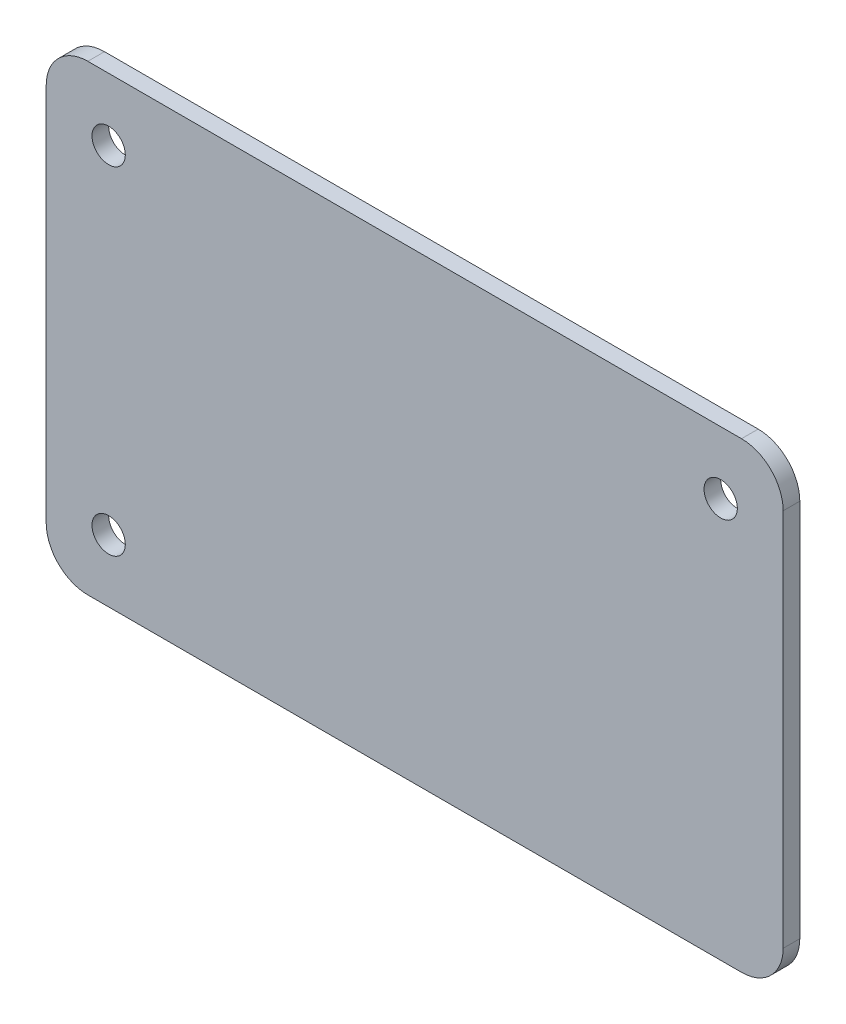
ISO-10303-21;
HEADER;
FILE_DESCRIPTION(('STEP AP214'),'2;1');
FILE_NAME('part.step','',(''),(''),'','','');
FILE_SCHEMA(('AUTOMOTIVE_DESIGN { 1 0 10303 214 1 1 1 1 }'));
ENDSEC;
DATA;
#1=APPLICATION_CONTEXT('core data for automotive mechanical design processes');
#2=APPLICATION_PROTOCOL_DEFINITION('international standard','automotive_design',2000,#1);
#3=PRODUCT_CONTEXT('',#1,'mechanical');
#4=PRODUCT('Part','Part','',(#3));
#5=PRODUCT_RELATED_PRODUCT_CATEGORY('part','',(#4));
#6=PRODUCT_DEFINITION_FORMATION('','',#4);
#7=PRODUCT_DEFINITION_CONTEXT('part definition',#1,'design');
#8=PRODUCT_DEFINITION('design','',#6,#7);
#9=PRODUCT_DEFINITION_SHAPE('','',#8);
#10=(LENGTH_UNIT() NAMED_UNIT(*) SI_UNIT(.MILLI.,.METRE.));
#11=(NAMED_UNIT(*) PLANE_ANGLE_UNIT() SI_UNIT($,.RADIAN.));
#12=(NAMED_UNIT(*) SI_UNIT($,.STERADIAN.) SOLID_ANGLE_UNIT());
#13=UNCERTAINTY_MEASURE_WITH_UNIT(LENGTH_MEASURE(1.E-05),#10,'distance_accuracy_value','');
#14=(GEOMETRIC_REPRESENTATION_CONTEXT(3) GLOBAL_UNCERTAINTY_ASSIGNED_CONTEXT((#13)) GLOBAL_UNIT_ASSIGNED_CONTEXT((#10,
#11,#12)) REPRESENTATION_CONTEXT('',''));
#15=CARTESIAN_POINT('',(0.,0.,0.));
#16=DIRECTION('',(0.,0.,1.));
#17=DIRECTION('',(1.,0.,0.));
#18=AXIS2_PLACEMENT_3D('',#15,#16,#17);
#19=CARTESIAN_POINT('',(-78.5,-45.5,4.));
#20=DIRECTION('',(0.,0.,-1.));
#21=DIRECTION('',(-1.,0.,0.));
#22=AXIS2_PLACEMENT_3D('',#19,#20,#21);
#23=PLANE('',#22);
#24=CARTESIAN_POINT('',(-78.5,-45.5,4.));
#25=DIRECTION('',(0.,0.,1.));
#26=DIRECTION('',(-1.,0.,0.));
#27=AXIS2_PLACEMENT_3D('',#24,#25,#26);
#28=CIRCLE('',#27,10.);
#29=CARTESIAN_POINT('',(-88.5,-45.4999999999999,4.));
#30=VERTEX_POINT('',#29);
#31=CARTESIAN_POINT('',(-78.4999999999999,-55.5,4.));
#32=VERTEX_POINT('',#31);
#33=EDGE_CURVE('E145',#30,#32,#28,.T.);
#34=ORIENTED_EDGE('',*,*,#33,.T.);
#35=DIRECTION('',(1.,0.,0.));
#36=VECTOR('',#35,1.);
#37=CARTESIAN_POINT('',(78.4999999999999,-55.5,4.));
#38=LINE('',#37,#36);
#39=CARTESIAN_POINT('',(78.4999999999999,-55.5,4.));
#40=VERTEX_POINT('',#39);
#41=EDGE_CURVE('E93',#32,#40,#38,.T.);
#42=ORIENTED_EDGE('',*,*,#41,.T.);
#43=CARTESIAN_POINT('',(78.5,-45.5,4.));
#44=DIRECTION('',(0.,0.,1.));
#45=DIRECTION('',(1.,0.,0.));
#46=AXIS2_PLACEMENT_3D('',#43,#44,#45);
#47=CIRCLE('',#46,10.);
#48=CARTESIAN_POINT('',(88.5,-45.5,4.));
#49=VERTEX_POINT('',#48);
#50=EDGE_CURVE('E160',#40,#49,#47,.T.);
#51=ORIENTED_EDGE('',*,*,#50,.T.);
#52=DIRECTION('',(0.,1.,0.));
#53=VECTOR('',#52,1.);
#54=CARTESIAN_POINT('',(88.5,-45.4999999999999,4.));
#55=LINE('',#54,#53);
#56=CARTESIAN_POINT('',(88.5,45.4999999999999,4.));
#57=VERTEX_POINT('',#56);
#58=EDGE_CURVE('E173',#49,#57,#55,.T.);
#59=ORIENTED_EDGE('',*,*,#58,.T.);
#60=CARTESIAN_POINT('',(78.5,45.5,4.));
#61=DIRECTION('',(0.,0.,1.));
#62=DIRECTION('',(1.,0.,0.));
#63=AXIS2_PLACEMENT_3D('',#60,#61,#62);
#64=CIRCLE('',#63,10.);
#65=CARTESIAN_POINT('',(78.4999999999999,55.5,4.));
#66=VERTEX_POINT('',#65);
#67=EDGE_CURVE('E112',#57,#66,#64,.T.);
#68=ORIENTED_EDGE('',*,*,#67,.T.);
#69=DIRECTION('',(-1.,0.,0.));
#70=VECTOR('',#69,1.);
#71=CARTESIAN_POINT('',(78.4999999999999,55.5,4.));
#72=LINE('',#71,#70);
#73=CARTESIAN_POINT('',(-78.4999999999999,55.5,4.));
#74=VERTEX_POINT('',#73);
#75=EDGE_CURVE('E106',#66,#74,#72,.T.);
#76=ORIENTED_EDGE('',*,*,#75,.T.);
#77=CARTESIAN_POINT('',(-78.5,45.5,4.));
#78=DIRECTION('',(0.,0.,1.));
#79=DIRECTION('',(1.,0.,0.));
#80=AXIS2_PLACEMENT_3D('',#77,#78,#79);
#81=CIRCLE('',#80,10.);
#82=CARTESIAN_POINT('',(-88.5,45.4999999999999,4.));
#83=VERTEX_POINT('',#82);
#84=EDGE_CURVE('E110',#74,#83,#81,.T.);
#85=ORIENTED_EDGE('',*,*,#84,.T.);
#86=DIRECTION('',(0.,-1.,0.));
#87=VECTOR('',#86,1.);
#88=CARTESIAN_POINT('',(-88.5,-45.4999999999999,4.));
#89=LINE('',#88,#87);
#90=EDGE_CURVE('E50',#83,#30,#89,.T.);
#91=ORIENTED_EDGE('',*,*,#90,.T.);
#92=EDGE_LOOP('',(#34,#42,#51,#59,#68,#76,#85,#91));
#93=FACE_BOUND('',#92,.T.);
#94=CARTESIAN_POINT('',(-73.5,40.5,4.));
#95=DIRECTION('',(0.,0.,1.));
#96=DIRECTION('',(1.,0.,0.));
#97=AXIS2_PLACEMENT_3D('',#94,#95,#96);
#98=CIRCLE('',#97,4.00000000000001);
#99=CARTESIAN_POINT('',(-69.5,40.5,4.));
#100=VERTEX_POINT('',#99);
#101=EDGE_CURVE('E134',#100,#100,#98,.T.);
#102=ORIENTED_EDGE('',*,*,#101,.F.);
#103=EDGE_LOOP('',(#102));
#104=FACE_BOUND('',#103,.T.);
#105=CARTESIAN_POINT('',(73.5,40.5,4.));
#106=DIRECTION('',(0.,0.,1.));
#107=DIRECTION('',(1.,0.,0.));
#108=AXIS2_PLACEMENT_3D('',#105,#106,#107);
#109=CIRCLE('',#108,4.00000000000001);
#110=CARTESIAN_POINT('',(77.5,40.5,4.));
#111=VERTEX_POINT('',#110);
#112=EDGE_CURVE('E182',#111,#111,#109,.T.);
#113=ORIENTED_EDGE('',*,*,#112,.F.);
#114=EDGE_LOOP('',(#113));
#115=FACE_BOUND('',#114,.T.);
#116=CARTESIAN_POINT('',(-73.5,-40.5,4.));
#117=DIRECTION('',(0.,0.,1.));
#118=DIRECTION('',(1.,0.,0.));
#119=AXIS2_PLACEMENT_3D('',#116,#117,#118);
#120=CIRCLE('',#119,4.00000000000001);
#121=CARTESIAN_POINT('',(-69.5,-40.5,4.));
#122=VERTEX_POINT('',#121);
#123=EDGE_CURVE('E188',#122,#122,#120,.T.);
#124=ORIENTED_EDGE('',*,*,#123,.F.);
#125=EDGE_LOOP('',(#124));
#126=FACE_BOUND('',#125,.T.);
#127=ADVANCED_FACE('F33',(#93,#104,#115,#126),#23,.F.);
#128=CARTESIAN_POINT('',(-78.5,-45.5,0.));
#129=DIRECTION('',(0.,0.,-1.));
#130=DIRECTION('',(-1.,0.,0.));
#131=AXIS2_PLACEMENT_3D('',#128,#129,#130);
#132=PLANE('',#131);
#133=CARTESIAN_POINT('',(73.5,40.5,0.));
#134=DIRECTION('',(0.,0.,1.));
#135=DIRECTION('',(1.,0.,0.));
#136=AXIS2_PLACEMENT_3D('',#133,#134,#135);
#137=CIRCLE('',#136,4.00000000000001);
#138=CARTESIAN_POINT('',(77.5,40.5,0.));
#139=VERTEX_POINT('',#138);
#140=EDGE_CURVE('E185',#139,#139,#137,.T.);
#141=ORIENTED_EDGE('',*,*,#140,.T.);
#142=EDGE_LOOP('',(#141));
#143=FACE_BOUND('',#142,.T.);
#144=CARTESIAN_POINT('',(-78.5,-45.5,0.));
#145=DIRECTION('',(0.,0.,1.));
#146=DIRECTION('',(-1.,0.,0.));
#147=AXIS2_PLACEMENT_3D('',#144,#145,#146);
#148=CIRCLE('',#147,10.);
#149=CARTESIAN_POINT('',(-88.5,-45.4999999999999,0.));
#150=VERTEX_POINT('',#149);
#151=CARTESIAN_POINT('',(-78.4999999999999,-55.5,0.));
#152=VERTEX_POINT('',#151);
#153=EDGE_CURVE('E130',#150,#152,#148,.T.);
#154=ORIENTED_EDGE('',*,*,#153,.F.);
#155=DIRECTION('',(0.,-1.,0.));
#156=VECTOR('',#155,1.);
#157=CARTESIAN_POINT('',(-88.5,-45.4999999999999,0.));
#158=LINE('',#157,#156);
#159=CARTESIAN_POINT('',(-88.5,45.4999999999999,0.));
#160=VERTEX_POINT('',#159);
#161=EDGE_CURVE('E85',#160,#150,#158,.T.);
#162=ORIENTED_EDGE('',*,*,#161,.F.);
#163=CARTESIAN_POINT('',(-78.5,45.5,0.));
#164=DIRECTION('',(0.,0.,1.));
#165=DIRECTION('',(1.,0.,0.));
#166=AXIS2_PLACEMENT_3D('',#163,#164,#165);
#167=CIRCLE('',#166,10.);
#168=CARTESIAN_POINT('',(-78.4999999999999,55.5,0.));
#169=VERTEX_POINT('',#168);
#170=EDGE_CURVE('E79',#169,#160,#167,.T.);
#171=ORIENTED_EDGE('',*,*,#170,.F.);
#172=DIRECTION('',(-1.,0.,0.));
#173=VECTOR('',#172,1.);
#174=CARTESIAN_POINT('',(78.4999999999999,55.5,0.));
#175=LINE('',#174,#173);
#176=CARTESIAN_POINT('',(78.4999999999999,55.5,0.));
#177=VERTEX_POINT('',#176);
#178=EDGE_CURVE('E120',#177,#169,#175,.T.);
#179=ORIENTED_EDGE('',*,*,#178,.F.);
#180=CARTESIAN_POINT('',(78.5,45.5,0.));
#181=DIRECTION('',(0.,0.,1.));
#182=DIRECTION('',(1.,0.,0.));
#183=AXIS2_PLACEMENT_3D('',#180,#181,#182);
#184=CIRCLE('',#183,10.);
#185=CARTESIAN_POINT('',(88.5,45.4999999999999,0.));
#186=VERTEX_POINT('',#185);
#187=EDGE_CURVE('E140',#186,#177,#184,.T.);
#188=ORIENTED_EDGE('',*,*,#187,.F.);
#189=DIRECTION('',(0.,1.,0.));
#190=VECTOR('',#189,1.);
#191=CARTESIAN_POINT('',(88.5,-45.4999999999999,0.));
#192=LINE('',#191,#190);
#193=CARTESIAN_POINT('',(88.5,-45.5,0.));
#194=VERTEX_POINT('',#193);
#195=EDGE_CURVE('E138',#194,#186,#192,.T.);
#196=ORIENTED_EDGE('',*,*,#195,.F.);
#197=CARTESIAN_POINT('',(78.5,-45.5,0.));
#198=DIRECTION('',(0.,0.,1.));
#199=DIRECTION('',(1.,0.,0.));
#200=AXIS2_PLACEMENT_3D('',#197,#198,#199);
#201=CIRCLE('',#200,10.);
#202=CARTESIAN_POINT('',(78.4999999999999,-55.5,0.));
#203=VERTEX_POINT('',#202);
#204=EDGE_CURVE('E136',#203,#194,#201,.T.);
#205=ORIENTED_EDGE('',*,*,#204,.F.);
#206=DIRECTION('',(1.,0.,0.));
#207=VECTOR('',#206,1.);
#208=CARTESIAN_POINT('',(78.4999999999999,-55.5,0.));
#209=LINE('',#208,#207);
#210=EDGE_CURVE('E133',#152,#203,#209,.T.);
#211=ORIENTED_EDGE('',*,*,#210,.F.);
#212=EDGE_LOOP('',(#154,#162,#171,#179,#188,#196,#205,#211));
#213=FACE_BOUND('',#212,.T.);
#214=CARTESIAN_POINT('',(-73.5,40.5,0.));
#215=DIRECTION('',(0.,0.,1.));
#216=DIRECTION('',(1.,0.,0.));
#217=AXIS2_PLACEMENT_3D('',#214,#215,#216);
#218=CIRCLE('',#217,4.00000000000001);
#219=CARTESIAN_POINT('',(-69.5,40.5,0.));
#220=VERTEX_POINT('',#219);
#221=EDGE_CURVE('E179',#220,#220,#218,.T.);
#222=ORIENTED_EDGE('',*,*,#221,.T.);
#223=EDGE_LOOP('',(#222));
#224=FACE_BOUND('',#223,.T.);
#225=CARTESIAN_POINT('',(-73.5,-40.5,0.));
#226=DIRECTION('',(0.,0.,1.));
#227=DIRECTION('',(1.,0.,0.));
#228=AXIS2_PLACEMENT_3D('',#225,#226,#227);
#229=CIRCLE('',#228,4.00000000000001);
#230=CARTESIAN_POINT('',(-69.5,-40.5,0.));
#231=VERTEX_POINT('',#230);
#232=EDGE_CURVE('E191',#231,#231,#229,.T.);
#233=ORIENTED_EDGE('',*,*,#232,.T.);
#234=EDGE_LOOP('',(#233));
#235=FACE_BOUND('',#234,.T.);
#236=ADVANCED_FACE('F164',(#143,#213,#224,#235),#132,.T.);
#237=CARTESIAN_POINT('',(-78.5,-45.5,4.));
#238=DIRECTION('',(0.,0.,-1.));
#239=DIRECTION('',(-1.,0.,0.));
#240=AXIS2_PLACEMENT_3D('',#237,#238,#239);
#241=CYLINDRICAL_SURFACE('',#240,10.);
#242=ORIENTED_EDGE('',*,*,#153,.T.);
#243=DIRECTION('',(0.,0.,-1.));
#244=VECTOR('',#243,1.);
#245=CARTESIAN_POINT('',(-78.4999999999999,-55.5,4.));
#246=LINE('',#245,#244);
#247=EDGE_CURVE('E11',#32,#152,#246,.T.);
#248=ORIENTED_EDGE('',*,*,#247,.F.);
#249=ORIENTED_EDGE('',*,*,#33,.F.);
#250=DIRECTION('',(0.,0.,-1.));
#251=VECTOR('',#250,1.);
#252=CARTESIAN_POINT('',(-88.5,-45.4999999999999,4.));
#253=LINE('',#252,#251);
#254=EDGE_CURVE('E126',#30,#150,#253,.T.);
#255=ORIENTED_EDGE('',*,*,#254,.T.);
#256=EDGE_LOOP('',(#242,#248,#249,#255));
#257=FACE_BOUND('',#256,.T.);
#258=ADVANCED_FACE('F35',(#257),#241,.T.);
#259=CARTESIAN_POINT('',(78.4999999999999,-55.5,4.));
#260=DIRECTION('',(0.,1.,0.));
#261=DIRECTION('',(-1.,0.,0.));
#262=AXIS2_PLACEMENT_3D('',#259,#260,#261);
#263=PLANE('',#262);
#264=ORIENTED_EDGE('',*,*,#210,.T.);
#265=DIRECTION('',(0.,0.,-1.));
#266=VECTOR('',#265,1.);
#267=CARTESIAN_POINT('',(78.4999999999999,-55.5,4.));
#268=LINE('',#267,#266);
#269=EDGE_CURVE('E42',#40,#203,#268,.T.);
#270=ORIENTED_EDGE('',*,*,#269,.F.);
#271=ORIENTED_EDGE('',*,*,#41,.F.);
#272=ORIENTED_EDGE('',*,*,#247,.T.);
#273=EDGE_LOOP('',(#264,#270,#271,#272));
#274=FACE_BOUND('',#273,.T.);
#275=ADVANCED_FACE('F223',(#274),#263,.F.);
#276=CARTESIAN_POINT('',(78.5,-45.5,4.));
#277=DIRECTION('',(0.,0.,-1.));
#278=DIRECTION('',(-1.,0.,0.));
#279=AXIS2_PLACEMENT_3D('',#276,#277,#278);
#280=CYLINDRICAL_SURFACE('',#279,10.);
#281=ORIENTED_EDGE('',*,*,#204,.T.);
#282=DIRECTION('',(0.,0.,-1.));
#283=VECTOR('',#282,1.);
#284=CARTESIAN_POINT('',(88.5,-45.5,4.));
#285=LINE('',#284,#283);
#286=EDGE_CURVE('E152',#49,#194,#285,.T.);
#287=ORIENTED_EDGE('',*,*,#286,.F.);
#288=ORIENTED_EDGE('',*,*,#50,.F.);
#289=ORIENTED_EDGE('',*,*,#269,.T.);
#290=EDGE_LOOP('',(#281,#287,#288,#289));
#291=FACE_BOUND('',#290,.T.);
#292=ADVANCED_FACE('F158',(#291),#280,.T.);
#293=CARTESIAN_POINT('',(88.5,-45.4999999999999,4.));
#294=DIRECTION('',(-1.,0.,0.));
#295=DIRECTION('',(0.,-1.,0.));
#296=AXIS2_PLACEMENT_3D('',#293,#294,#295);
#297=PLANE('',#296);
#298=ORIENTED_EDGE('',*,*,#195,.T.);
#299=DIRECTION('',(0.,0.,-1.));
#300=VECTOR('',#299,1.);
#301=CARTESIAN_POINT('',(88.5,45.4999999999999,4.));
#302=LINE('',#301,#300);
#303=EDGE_CURVE('E149',#57,#186,#302,.T.);
#304=ORIENTED_EDGE('',*,*,#303,.F.);
#305=ORIENTED_EDGE('',*,*,#58,.F.);
#306=ORIENTED_EDGE('',*,*,#286,.T.);
#307=EDGE_LOOP('',(#298,#304,#305,#306));
#308=FACE_BOUND('',#307,.T.);
#309=ADVANCED_FACE('F169',(#308),#297,.F.);
#310=CARTESIAN_POINT('',(78.5,45.5,4.));
#311=DIRECTION('',(0.,0.,-1.));
#312=DIRECTION('',(-1.,0.,0.));
#313=AXIS2_PLACEMENT_3D('',#310,#311,#312);
#314=CYLINDRICAL_SURFACE('',#313,10.);
#315=ORIENTED_EDGE('',*,*,#187,.T.);
#316=DIRECTION('',(0.,0.,-1.));
#317=VECTOR('',#316,1.);
#318=CARTESIAN_POINT('',(78.4999999999999,55.5,4.));
#319=LINE('',#318,#317);
#320=EDGE_CURVE('E121',#66,#177,#319,.T.);
#321=ORIENTED_EDGE('',*,*,#320,.F.);
#322=ORIENTED_EDGE('',*,*,#67,.F.);
#323=ORIENTED_EDGE('',*,*,#303,.T.);
#324=EDGE_LOOP('',(#315,#321,#322,#323));
#325=FACE_BOUND('',#324,.T.);
#326=ADVANCED_FACE('F172',(#325),#314,.T.);
#327=CARTESIAN_POINT('',(78.4999999999999,55.5,4.));
#328=DIRECTION('',(0.,-1.,0.));
#329=DIRECTION('',(1.,0.,0.));
#330=AXIS2_PLACEMENT_3D('',#327,#328,#329);
#331=PLANE('',#330);
#332=ORIENTED_EDGE('',*,*,#178,.T.);
#333=DIRECTION('',(0.,0.,-1.));
#334=VECTOR('',#333,1.);
#335=CARTESIAN_POINT('',(-78.4999999999999,55.5,4.));
#336=LINE('',#335,#334);
#337=EDGE_CURVE('E117',#74,#169,#336,.T.);
#338=ORIENTED_EDGE('',*,*,#337,.F.);
#339=ORIENTED_EDGE('',*,*,#75,.F.);
#340=ORIENTED_EDGE('',*,*,#320,.T.);
#341=EDGE_LOOP('',(#332,#338,#339,#340));
#342=FACE_BOUND('',#341,.T.);
#343=ADVANCED_FACE('F118',(#342),#331,.F.);
#344=CARTESIAN_POINT('',(-78.5,45.5,4.));
#345=DIRECTION('',(0.,0.,-1.));
#346=DIRECTION('',(-1.,0.,0.));
#347=AXIS2_PLACEMENT_3D('',#344,#345,#346);
#348=CYLINDRICAL_SURFACE('',#347,10.);
#349=ORIENTED_EDGE('',*,*,#170,.T.);
#350=DIRECTION('',(0.,0.,-1.));
#351=VECTOR('',#350,1.);
#352=CARTESIAN_POINT('',(-88.5,45.4999999999999,4.));
#353=LINE('',#352,#351);
#354=EDGE_CURVE('E122',#83,#160,#353,.T.);
#355=ORIENTED_EDGE('',*,*,#354,.F.);
#356=ORIENTED_EDGE('',*,*,#84,.F.);
#357=ORIENTED_EDGE('',*,*,#337,.T.);
#358=EDGE_LOOP('',(#349,#355,#356,#357));
#359=FACE_BOUND('',#358,.T.);
#360=ADVANCED_FACE('F124',(#359),#348,.T.);
#361=CARTESIAN_POINT('',(-88.5,-45.4999999999999,4.));
#362=DIRECTION('',(1.,0.,0.));
#363=DIRECTION('',(0.,0.,-1.));
#364=AXIS2_PLACEMENT_3D('',#361,#362,#363);
#365=PLANE('',#364);
#366=ORIENTED_EDGE('',*,*,#161,.T.);
#367=ORIENTED_EDGE('',*,*,#254,.F.);
#368=ORIENTED_EDGE('',*,*,#90,.F.);
#369=ORIENTED_EDGE('',*,*,#354,.T.);
#370=EDGE_LOOP('',(#366,#367,#368,#369));
#371=FACE_BOUND('',#370,.T.);
#372=ADVANCED_FACE('F211',(#371),#365,.F.);
#373=CARTESIAN_POINT('',(-73.5,40.5,4.));
#374=DIRECTION('',(0.,0.,-1.));
#375=DIRECTION('',(-1.,0.,0.));
#376=AXIS2_PLACEMENT_3D('',#373,#374,#375);
#377=CYLINDRICAL_SURFACE('',#376,4.00000000000001);
#378=ORIENTED_EDGE('',*,*,#101,.T.);
#379=EDGE_LOOP('',(#378));
#380=FACE_BOUND('',#379,.T.);
#381=ORIENTED_EDGE('',*,*,#221,.F.);
#382=EDGE_LOOP('',(#381));
#383=FACE_BOUND('',#382,.T.);
#384=ADVANCED_FACE('F208',(#380,#383),#377,.F.);
#385=CARTESIAN_POINT('',(73.5,40.5,4.));
#386=DIRECTION('',(0.,0.,-1.));
#387=DIRECTION('',(-1.,0.,0.));
#388=AXIS2_PLACEMENT_3D('',#385,#386,#387);
#389=CYLINDRICAL_SURFACE('',#388,4.00000000000001);
#390=ORIENTED_EDGE('',*,*,#112,.T.);
#391=EDGE_LOOP('',(#390));
#392=FACE_BOUND('',#391,.T.);
#393=ORIENTED_EDGE('',*,*,#140,.F.);
#394=EDGE_LOOP('',(#393));
#395=FACE_BOUND('',#394,.T.);
#396=ADVANCED_FACE('F287',(#392,#395),#389,.F.);
#397=CARTESIAN_POINT('',(-73.5,-40.5,4.));
#398=DIRECTION('',(0.,0.,-1.));
#399=DIRECTION('',(-1.,0.,0.));
#400=AXIS2_PLACEMENT_3D('',#397,#398,#399);
#401=CYLINDRICAL_SURFACE('',#400,4.00000000000001);
#402=ORIENTED_EDGE('',*,*,#123,.T.);
#403=EDGE_LOOP('',(#402));
#404=FACE_BOUND('',#403,.T.);
#405=ORIENTED_EDGE('',*,*,#232,.F.);
#406=EDGE_LOOP('',(#405));
#407=FACE_BOUND('',#406,.T.);
#408=ADVANCED_FACE('F197',(#404,#407),#401,.F.);
#409=CLOSED_SHELL('',(#127,#236,#258,#275,#292,#309,#326,#343,#360,#372,#384,#396,#408));
#410=MANIFOLD_SOLID_BREP('B2',#409);
#411=ADVANCED_BREP_SHAPE_REPRESENTATION('',(#18,#410),#14);
#412=SHAPE_DEFINITION_REPRESENTATION(#9,#411);
ENDSEC;
END-ISO-10303-21;
